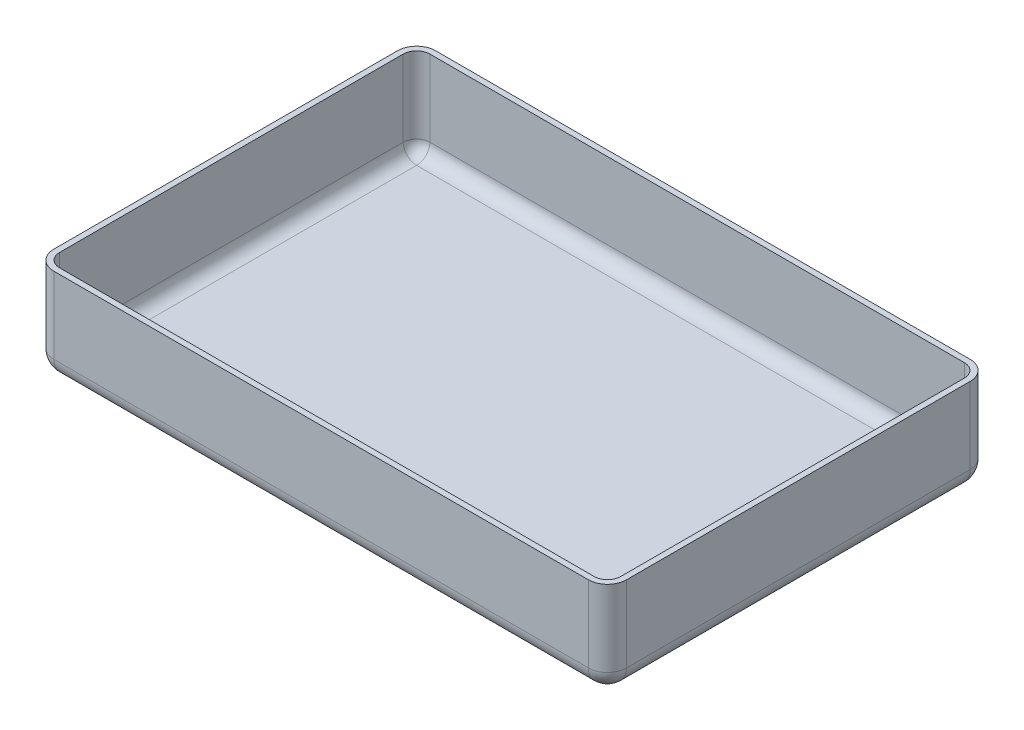
ISO-10303-21;
HEADER;
FILE_DESCRIPTION(('STEP AP214'),'2;1');
FILE_NAME('part.step','',(''),(''),'','','');
FILE_SCHEMA(('AUTOMOTIVE_DESIGN { 1 0 10303 214 1 1 1 1 }'));
ENDSEC;
DATA;
#1=APPLICATION_CONTEXT('core data for automotive mechanical design processes');
#2=APPLICATION_PROTOCOL_DEFINITION('international standard','automotive_design',2000,#1);
#3=PRODUCT_CONTEXT('',#1,'mechanical');
#4=PRODUCT('Part','Part','',(#3));
#5=PRODUCT_RELATED_PRODUCT_CATEGORY('part','',(#4));
#6=PRODUCT_DEFINITION_FORMATION('','',#4);
#7=PRODUCT_DEFINITION_CONTEXT('part definition',#1,'design');
#8=PRODUCT_DEFINITION('design','',#6,#7);
#9=PRODUCT_DEFINITION_SHAPE('','',#8);
#10=(LENGTH_UNIT() NAMED_UNIT(*) SI_UNIT(.MILLI.,.METRE.));
#11=(NAMED_UNIT(*) PLANE_ANGLE_UNIT() SI_UNIT($,.RADIAN.));
#12=(NAMED_UNIT(*) SI_UNIT($,.STERADIAN.) SOLID_ANGLE_UNIT());
#13=UNCERTAINTY_MEASURE_WITH_UNIT(LENGTH_MEASURE(1.E-05),#10,'distance_accuracy_value','');
#14=(GEOMETRIC_REPRESENTATION_CONTEXT(3) GLOBAL_UNCERTAINTY_ASSIGNED_CONTEXT((#13)) GLOBAL_UNIT_ASSIGNED_CONTEXT((#10,
#11,#12)) REPRESENTATION_CONTEXT('',''));
#15=CARTESIAN_POINT('',(0.,0.,0.));
#16=DIRECTION('',(0.,0.,1.));
#17=DIRECTION('',(1.,0.,0.));
#18=AXIS2_PLACEMENT_3D('',#15,#16,#17);
#19=CARTESIAN_POINT('',(-150.,50.,100.));
#20=DIRECTION('',(1.,0.,0.));
#21=DIRECTION('',(0.,0.,-1.));
#22=AXIS2_PLACEMENT_3D('',#19,#20,#21);
#23=PLANE('',#22);
#24=DIRECTION('',(0.,0.,1.));
#25=VECTOR('',#24,1.);
#26=CARTESIAN_POINT('',(-150.,50.,100.));
#27=LINE('',#26,#25);
#28=CARTESIAN_POINT('',(-150.,50.,-90.));
#29=VERTEX_POINT('',#28);
#30=CARTESIAN_POINT('',(-150.,50.,90.));
#31=VERTEX_POINT('',#30);
#32=EDGE_CURVE('E321',#29,#31,#27,.T.);
#33=ORIENTED_EDGE('',*,*,#32,.F.);
#34=DIRECTION('',(0.,-1.,0.));
#35=VECTOR('',#34,1.);
#36=CARTESIAN_POINT('',(-150.,50.,-90.));
#37=LINE('',#36,#35);
#38=CARTESIAN_POINT('',(-150.,10.,-90.));
#39=VERTEX_POINT('',#38);
#40=EDGE_CURVE('E65',#29,#39,#37,.T.);
#41=ORIENTED_EDGE('',*,*,#40,.T.);
#42=DIRECTION('',(0.,0.,1.));
#43=VECTOR('',#42,1.);
#44=CARTESIAN_POINT('',(-150.,10.,100.));
#45=LINE('',#44,#43);
#46=CARTESIAN_POINT('',(-150.,10.,90.));
#47=VERTEX_POINT('',#46);
#48=EDGE_CURVE('E381',#39,#47,#45,.T.);
#49=ORIENTED_EDGE('',*,*,#48,.T.);
#50=DIRECTION('',(0.,-1.,0.));
#51=VECTOR('',#50,1.);
#52=CARTESIAN_POINT('',(-150.,50.,90.));
#53=LINE('',#52,#51);
#54=EDGE_CURVE('E378',#47,#31,#53,.F.);
#55=ORIENTED_EDGE('',*,*,#54,.T.);
#56=EDGE_LOOP('',(#33,#41,#49,#55));
#57=FACE_BOUND('',#56,.T.);
#58=ADVANCED_FACE('F39',(#57),#23,.F.);
#59=CARTESIAN_POINT('',(150.,50.,100.));
#60=DIRECTION('',(0.,0.,-1.));
#61=DIRECTION('',(-1.,0.,0.));
#62=AXIS2_PLACEMENT_3D('',#59,#60,#61);
#63=PLANE('',#62);
#64=DIRECTION('',(1.,0.,0.));
#65=VECTOR('',#64,1.);
#66=CARTESIAN_POINT('',(150.,10.,100.));
#67=LINE('',#66,#65);
#68=CARTESIAN_POINT('',(-140.,10.,100.));
#69=VERTEX_POINT('',#68);
#70=CARTESIAN_POINT('',(140.,10.,100.));
#71=VERTEX_POINT('',#70);
#72=EDGE_CURVE('E340',#69,#71,#67,.T.);
#73=ORIENTED_EDGE('',*,*,#72,.T.);
#74=DIRECTION('',(0.,-1.,0.));
#75=VECTOR('',#74,1.);
#76=CARTESIAN_POINT('',(140.,50.,100.));
#77=LINE('',#76,#75);
#78=CARTESIAN_POINT('',(140.,50.,100.));
#79=VERTEX_POINT('',#78);
#80=EDGE_CURVE('E344',#71,#79,#77,.F.);
#81=ORIENTED_EDGE('',*,*,#80,.T.);
#82=DIRECTION('',(1.,0.,0.));
#83=VECTOR('',#82,1.);
#84=CARTESIAN_POINT('',(150.,50.,100.));
#85=LINE('',#84,#83);
#86=CARTESIAN_POINT('',(-140.,50.,100.));
#87=VERTEX_POINT('',#86);
#88=EDGE_CURVE('E325',#87,#79,#85,.T.);
#89=ORIENTED_EDGE('',*,*,#88,.F.);
#90=DIRECTION('',(0.,-1.,0.));
#91=VECTOR('',#90,1.);
#92=CARTESIAN_POINT('',(-140.,50.,100.));
#93=LINE('',#92,#91);
#94=EDGE_CURVE('E337',#87,#69,#93,.T.);
#95=ORIENTED_EDGE('',*,*,#94,.T.);
#96=EDGE_LOOP('',(#73,#81,#89,#95));
#97=FACE_BOUND('',#96,.T.);
#98=ADVANCED_FACE('F459',(#97),#63,.F.);
#99=CARTESIAN_POINT('',(150.,50.,100.));
#100=DIRECTION('',(-1.,0.,0.));
#101=DIRECTION('',(0.,0.,1.));
#102=AXIS2_PLACEMENT_3D('',#99,#100,#101);
#103=PLANE('',#102);
#104=DIRECTION('',(0.,0.,-1.));
#105=VECTOR('',#104,1.);
#106=CARTESIAN_POINT('',(150.,10.,100.));
#107=LINE('',#106,#105);
#108=CARTESIAN_POINT('',(150.,10.,90.));
#109=VERTEX_POINT('',#108);
#110=CARTESIAN_POINT('',(150.,10.,-90.));
#111=VERTEX_POINT('',#110);
#112=EDGE_CURVE('E363',#109,#111,#107,.T.);
#113=ORIENTED_EDGE('',*,*,#112,.T.);
#114=DIRECTION('',(0.,-1.,0.));
#115=VECTOR('',#114,1.);
#116=CARTESIAN_POINT('',(150.,50.,-90.));
#117=LINE('',#116,#115);
#118=CARTESIAN_POINT('',(150.,50.,-90.));
#119=VERTEX_POINT('',#118);
#120=EDGE_CURVE('E366',#111,#119,#117,.F.);
#121=ORIENTED_EDGE('',*,*,#120,.T.);
#122=DIRECTION('',(0.,0.,-1.));
#123=VECTOR('',#122,1.);
#124=CARTESIAN_POINT('',(150.,50.,100.));
#125=LINE('',#124,#123);
#126=CARTESIAN_POINT('',(150.,50.,90.));
#127=VERTEX_POINT('',#126);
#128=EDGE_CURVE('E329',#127,#119,#125,.T.);
#129=ORIENTED_EDGE('',*,*,#128,.F.);
#130=DIRECTION('',(0.,-1.,0.));
#131=VECTOR('',#130,1.);
#132=CARTESIAN_POINT('',(150.,50.,90.));
#133=LINE('',#132,#131);
#134=EDGE_CURVE('E360',#127,#109,#133,.T.);
#135=ORIENTED_EDGE('',*,*,#134,.T.);
#136=EDGE_LOOP('',(#113,#121,#129,#135));
#137=FACE_BOUND('',#136,.T.);
#138=ADVANCED_FACE('F469',(#137),#103,.F.);
#139=CARTESIAN_POINT('',(150.,50.,-100.));
#140=DIRECTION('',(0.,0.,1.));
#141=DIRECTION('',(1.,0.,0.));
#142=AXIS2_PLACEMENT_3D('',#139,#140,#141);
#143=PLANE('',#142);
#144=DIRECTION('',(-1.,0.,0.));
#145=VECTOR('',#144,1.);
#146=CARTESIAN_POINT('',(150.,10.,-100.));
#147=LINE('',#146,#145);
#148=CARTESIAN_POINT('',(140.,10.,-100.));
#149=VERTEX_POINT('',#148);
#150=CARTESIAN_POINT('',(-140.,10.,-100.));
#151=VERTEX_POINT('',#150);
#152=EDGE_CURVE('E372',#149,#151,#147,.T.);
#153=ORIENTED_EDGE('',*,*,#152,.T.);
#154=DIRECTION('',(0.,-1.,0.));
#155=VECTOR('',#154,1.);
#156=CARTESIAN_POINT('',(-140.,50.,-100.));
#157=LINE('',#156,#155);
#158=CARTESIAN_POINT('',(-140.,50.,-100.));
#159=VERTEX_POINT('',#158);
#160=EDGE_CURVE('E375',#151,#159,#157,.F.);
#161=ORIENTED_EDGE('',*,*,#160,.T.);
#162=DIRECTION('',(-1.,0.,0.));
#163=VECTOR('',#162,1.);
#164=CARTESIAN_POINT('',(150.,50.,-100.));
#165=LINE('',#164,#163);
#166=CARTESIAN_POINT('',(140.,50.,-100.));
#167=VERTEX_POINT('',#166);
#168=EDGE_CURVE('E333',#167,#159,#165,.T.);
#169=ORIENTED_EDGE('',*,*,#168,.F.);
#170=DIRECTION('',(0.,-1.,0.));
#171=VECTOR('',#170,1.);
#172=CARTESIAN_POINT('',(140.,50.,-100.));
#173=LINE('',#172,#171);
#174=EDGE_CURVE('E369',#167,#149,#173,.T.);
#175=ORIENTED_EDGE('',*,*,#174,.T.);
#176=EDGE_LOOP('',(#153,#161,#169,#175));
#177=FACE_BOUND('',#176,.T.);
#178=ADVANCED_FACE('F490',(#177),#143,.F.);
#179=CARTESIAN_POINT('',(0.,50.,0.));
#180=DIRECTION('',(0.,1.,0.));
#181=DIRECTION('',(0.,0.,1.));
#182=AXIS2_PLACEMENT_3D('',#179,#180,#181);
#183=PLANE('',#182);
#184=DIRECTION('',(-1.,0.,0.));
#185=VECTOR('',#184,1.);
#186=CARTESIAN_POINT('',(150.,50.,-97.));
#187=LINE('',#186,#185);
#188=CARTESIAN_POINT('',(140.,50.,-97.));
#189=VERTEX_POINT('',#188);
#190=CARTESIAN_POINT('',(-140.,50.,-97.));
#191=VERTEX_POINT('',#190);
#192=EDGE_CURVE('E280',#189,#191,#187,.T.);
#193=ORIENTED_EDGE('',*,*,#192,.F.);
#194=CARTESIAN_POINT('',(140.,50.,-90.));
#195=DIRECTION('',(0.,1.,0.));
#196=DIRECTION('',(0.,0.,1.));
#197=AXIS2_PLACEMENT_3D('',#194,#195,#196);
#198=CIRCLE('',#197,7.);
#199=CARTESIAN_POINT('',(147.,50.,-90.));
#200=VERTEX_POINT('',#199);
#201=EDGE_CURVE('E310',#200,#189,#198,.T.);
#202=ORIENTED_EDGE('',*,*,#201,.F.);
#203=DIRECTION('',(0.,0.,-1.));
#204=VECTOR('',#203,1.);
#205=CARTESIAN_POINT('',(147.,50.,100.));
#206=LINE('',#205,#204);
#207=CARTESIAN_POINT('',(147.,50.,90.));
#208=VERTEX_POINT('',#207);
#209=EDGE_CURVE('E57',#208,#200,#206,.T.);
#210=ORIENTED_EDGE('',*,*,#209,.F.);
#211=CARTESIAN_POINT('',(140.,50.,90.));
#212=DIRECTION('',(0.,1.,0.));
#213=DIRECTION('',(0.,0.,1.));
#214=AXIS2_PLACEMENT_3D('',#211,#212,#213);
#215=CIRCLE('',#214,7.);
#216=CARTESIAN_POINT('',(140.,50.,97.));
#217=VERTEX_POINT('',#216);
#218=EDGE_CURVE('E304',#217,#208,#215,.T.);
#219=ORIENTED_EDGE('',*,*,#218,.F.);
#220=DIRECTION('',(1.,0.,0.));
#221=VECTOR('',#220,1.);
#222=CARTESIAN_POINT('',(150.,50.,97.));
#223=LINE('',#222,#221);
#224=CARTESIAN_POINT('',(-140.,50.,97.));
#225=VERTEX_POINT('',#224);
#226=EDGE_CURVE('E301',#225,#217,#223,.T.);
#227=ORIENTED_EDGE('',*,*,#226,.F.);
#228=CARTESIAN_POINT('',(-140.,50.,90.));
#229=DIRECTION('',(0.,1.,0.));
#230=DIRECTION('',(0.,0.,1.));
#231=AXIS2_PLACEMENT_3D('',#228,#229,#230);
#232=CIRCLE('',#231,7.);
#233=CARTESIAN_POINT('',(-147.,50.,90.));
#234=VERTEX_POINT('',#233);
#235=EDGE_CURVE('E192',#234,#225,#232,.T.);
#236=ORIENTED_EDGE('',*,*,#235,.F.);
#237=DIRECTION('',(0.,0.,1.));
#238=VECTOR('',#237,1.);
#239=CARTESIAN_POINT('',(-147.,50.,100.));
#240=LINE('',#239,#238);
#241=CARTESIAN_POINT('',(-147.,50.,-90.));
#242=VERTEX_POINT('',#241);
#243=EDGE_CURVE('E267',#242,#234,#240,.T.);
#244=ORIENTED_EDGE('',*,*,#243,.F.);
#245=CARTESIAN_POINT('',(-140.,50.,-90.));
#246=DIRECTION('',(0.,1.,0.));
#247=DIRECTION('',(0.,0.,1.));
#248=AXIS2_PLACEMENT_3D('',#245,#246,#247);
#249=CIRCLE('',#248,7.);
#250=EDGE_CURVE('E186',#191,#242,#249,.T.);
#251=ORIENTED_EDGE('',*,*,#250,.F.);
#252=EDGE_LOOP('',(#193,#202,#210,#219,#227,#236,#244,#251));
#253=FACE_BOUND('',#252,.T.);
#254=ORIENTED_EDGE('',*,*,#168,.T.);
#255=CARTESIAN_POINT('',(-140.,50.,-90.));
#256=DIRECTION('',(0.,1.,0.));
#257=DIRECTION('',(0.,0.,1.));
#258=AXIS2_PLACEMENT_3D('',#255,#256,#257);
#259=CIRCLE('',#258,10.);
#260=EDGE_CURVE('E11',#159,#29,#259,.T.);
#261=ORIENTED_EDGE('',*,*,#260,.T.);
#262=ORIENTED_EDGE('',*,*,#32,.T.);
#263=CARTESIAN_POINT('',(-140.,50.,90.));
#264=DIRECTION('',(0.,1.,0.));
#265=DIRECTION('',(0.,0.,1.));
#266=AXIS2_PLACEMENT_3D('',#263,#264,#265);
#267=CIRCLE('',#266,10.);
#268=EDGE_CURVE('E386',#31,#87,#267,.T.);
#269=ORIENTED_EDGE('',*,*,#268,.T.);
#270=ORIENTED_EDGE('',*,*,#88,.T.);
#271=CARTESIAN_POINT('',(140.,50.,90.));
#272=DIRECTION('',(0.,1.,0.));
#273=DIRECTION('',(0.,0.,1.));
#274=AXIS2_PLACEMENT_3D('',#271,#272,#273);
#275=CIRCLE('',#274,10.);
#276=EDGE_CURVE('E389',#79,#127,#275,.T.);
#277=ORIENTED_EDGE('',*,*,#276,.T.);
#278=ORIENTED_EDGE('',*,*,#128,.T.);
#279=CARTESIAN_POINT('',(140.,50.,-90.));
#280=DIRECTION('',(0.,1.,0.));
#281=DIRECTION('',(0.,0.,1.));
#282=AXIS2_PLACEMENT_3D('',#279,#280,#281);
#283=CIRCLE('',#282,10.);
#284=EDGE_CURVE('E49',#119,#167,#283,.T.);
#285=ORIENTED_EDGE('',*,*,#284,.T.);
#286=EDGE_LOOP('',(#254,#261,#262,#269,#270,#277,#278,#285));
#287=FACE_BOUND('',#286,.T.);
#288=ADVANCED_FACE('F456',(#253,#287),#183,.T.);
#289=CARTESIAN_POINT('',(0.,0.,0.));
#290=DIRECTION('',(0.,1.,0.));
#291=DIRECTION('',(0.,0.,1.));
#292=AXIS2_PLACEMENT_3D('',#289,#290,#291);
#293=PLANE('',#292);
#294=DIRECTION('',(0.,0.,-1.));
#295=VECTOR('',#294,1.);
#296=CARTESIAN_POINT('',(140.,0.,0.));
#297=LINE('',#296,#295);
#298=CARTESIAN_POINT('',(140.,0.,-90.));
#299=VERTEX_POINT('',#298);
#300=CARTESIAN_POINT('',(140.,0.,90.));
#301=VERTEX_POINT('',#300);
#302=EDGE_CURVE('E353',#299,#301,#297,.F.);
#303=ORIENTED_EDGE('',*,*,#302,.T.);
#304=DIRECTION('',(1.,0.,0.));
#305=VECTOR('',#304,1.);
#306=CARTESIAN_POINT('',(0.,0.,90.));
#307=LINE('',#306,#305);
#308=CARTESIAN_POINT('',(-140.,0.,90.));
#309=VERTEX_POINT('',#308);
#310=EDGE_CURVE('E356',#301,#309,#307,.F.);
#311=ORIENTED_EDGE('',*,*,#310,.T.);
#312=DIRECTION('',(0.,0.,1.));
#313=VECTOR('',#312,1.);
#314=CARTESIAN_POINT('',(-140.,0.,0.));
#315=LINE('',#314,#313);
#316=CARTESIAN_POINT('',(-140.,0.,-90.));
#317=VERTEX_POINT('',#316);
#318=EDGE_CURVE('E347',#309,#317,#315,.F.);
#319=ORIENTED_EDGE('',*,*,#318,.T.);
#320=DIRECTION('',(-1.,0.,0.));
#321=VECTOR('',#320,1.);
#322=CARTESIAN_POINT('',(0.,0.,-90.));
#323=LINE('',#322,#321);
#324=EDGE_CURVE('E350',#317,#299,#323,.F.);
#325=ORIENTED_EDGE('',*,*,#324,.T.);
#326=EDGE_LOOP('',(#303,#311,#319,#325));
#327=FACE_BOUND('',#326,.T.);
#328=ADVANCED_FACE('F486',(#327),#293,.F.);
#329=CARTESIAN_POINT('',(-140.,50.,-90.));
#330=DIRECTION('',(0.,-1.,0.));
#331=DIRECTION('',(0.,0.,-1.));
#332=AXIS2_PLACEMENT_3D('',#329,#330,#331);
#333=CYLINDRICAL_SURFACE('',#332,10.);
#334=ORIENTED_EDGE('',*,*,#260,.F.);
#335=ORIENTED_EDGE('',*,*,#160,.F.);
#336=CARTESIAN_POINT('',(-140.,10.,-90.));
#337=DIRECTION('',(0.,-1.,0.));
#338=DIRECTION('',(0.,0.,-1.));
#339=AXIS2_PLACEMENT_3D('',#336,#337,#338);
#340=CIRCLE('',#339,10.);
#341=EDGE_CURVE('E430',#39,#151,#340,.T.);
#342=ORIENTED_EDGE('',*,*,#341,.F.);
#343=ORIENTED_EDGE('',*,*,#40,.F.);
#344=EDGE_LOOP('',(#334,#335,#342,#343));
#345=FACE_BOUND('',#344,.T.);
#346=ADVANCED_FACE('F41',(#345),#333,.T.);
#347=CARTESIAN_POINT('',(140.,50.,-90.));
#348=DIRECTION('',(0.,-1.,0.));
#349=DIRECTION('',(0.,0.,-1.));
#350=AXIS2_PLACEMENT_3D('',#347,#348,#349);
#351=CYLINDRICAL_SURFACE('',#350,10.);
#352=ORIENTED_EDGE('',*,*,#284,.F.);
#353=ORIENTED_EDGE('',*,*,#120,.F.);
#354=CARTESIAN_POINT('',(140.,10.,-90.));
#355=DIRECTION('',(0.,-1.,0.));
#356=DIRECTION('',(0.,0.,-1.));
#357=AXIS2_PLACEMENT_3D('',#354,#355,#356);
#358=CIRCLE('',#357,10.);
#359=EDGE_CURVE('E427',#149,#111,#358,.T.);
#360=ORIENTED_EDGE('',*,*,#359,.F.);
#361=ORIENTED_EDGE('',*,*,#174,.F.);
#362=EDGE_LOOP('',(#352,#353,#360,#361));
#363=FACE_BOUND('',#362,.T.);
#364=ADVANCED_FACE('F474',(#363),#351,.T.);
#365=CARTESIAN_POINT('',(150.,10.,-90.));
#366=DIRECTION('',(-1.,0.,0.));
#367=DIRECTION('',(0.,0.,1.));
#368=AXIS2_PLACEMENT_3D('',#365,#366,#367);
#369=CYLINDRICAL_SURFACE('',#368,10.);
#370=CARTESIAN_POINT('',(-140.,10.,-90.));
#371=DIRECTION('',(-1.,0.,0.));
#372=DIRECTION('',(0.,0.,1.));
#373=AXIS2_PLACEMENT_3D('',#370,#371,#372);
#374=CIRCLE('',#373,10.);
#375=EDGE_CURVE('E43',#151,#317,#374,.T.);
#376=ORIENTED_EDGE('',*,*,#375,.F.);
#377=ORIENTED_EDGE('',*,*,#152,.F.);
#378=CARTESIAN_POINT('',(140.,10.,-90.));
#379=DIRECTION('',(1.,0.,0.));
#380=DIRECTION('',(0.,0.,-1.));
#381=AXIS2_PLACEMENT_3D('',#378,#379,#380);
#382=CIRCLE('',#381,10.);
#383=EDGE_CURVE('E423',#299,#149,#382,.T.);
#384=ORIENTED_EDGE('',*,*,#383,.F.);
#385=ORIENTED_EDGE('',*,*,#324,.F.);
#386=EDGE_LOOP('',(#376,#377,#384,#385));
#387=FACE_BOUND('',#386,.T.);
#388=ADVANCED_FACE('F487',(#387),#369,.T.);
#389=CARTESIAN_POINT('',(-140.,10.,-90.));
#390=DIRECTION('',(0.,0.,1.));
#391=DIRECTION('',(1.,0.,0.));
#392=AXIS2_PLACEMENT_3D('',#389,#390,#391);
#393=SPHERICAL_SURFACE('',#392,10.);
#394=ORIENTED_EDGE('',*,*,#341,.T.);
#395=ORIENTED_EDGE('',*,*,#375,.T.);
#396=CARTESIAN_POINT('',(-140.,10.,-90.));
#397=DIRECTION('',(0.,0.,-1.));
#398=DIRECTION('',(-1.,0.,0.));
#399=AXIS2_PLACEMENT_3D('',#396,#397,#398);
#400=CIRCLE('',#399,10.);
#401=EDGE_CURVE('E419',#39,#317,#400,.F.);
#402=ORIENTED_EDGE('',*,*,#401,.F.);
#403=EDGE_LOOP('',(#394,#395,#402));
#404=FACE_BOUND('',#403,.T.);
#405=ADVANCED_FACE('F438',(#404),#393,.T.);
#406=CARTESIAN_POINT('',(140.,10.,-90.));
#407=DIRECTION('',(0.,0.,1.));
#408=DIRECTION('',(1.,0.,0.));
#409=AXIS2_PLACEMENT_3D('',#406,#407,#408);
#410=SPHERICAL_SURFACE('',#409,10.);
#411=ORIENTED_EDGE('',*,*,#383,.T.);
#412=ORIENTED_EDGE('',*,*,#359,.T.);
#413=CARTESIAN_POINT('',(140.,10.,-90.));
#414=DIRECTION('',(0.,0.,-1.));
#415=DIRECTION('',(-1.,0.,0.));
#416=AXIS2_PLACEMENT_3D('',#413,#414,#415);
#417=CIRCLE('',#416,10.);
#418=EDGE_CURVE('E415',#299,#111,#417,.F.);
#419=ORIENTED_EDGE('',*,*,#418,.F.);
#420=EDGE_LOOP('',(#411,#412,#419));
#421=FACE_BOUND('',#420,.T.);
#422=ADVANCED_FACE('F478',(#421),#410,.T.);
#423=CARTESIAN_POINT('',(-140.,10.,100.));
#424=DIRECTION('',(0.,0.,1.));
#425=DIRECTION('',(1.,0.,0.));
#426=AXIS2_PLACEMENT_3D('',#423,#424,#425);
#427=CYLINDRICAL_SURFACE('',#426,10.);
#428=ORIENTED_EDGE('',*,*,#401,.T.);
#429=ORIENTED_EDGE('',*,*,#318,.F.);
#430=CARTESIAN_POINT('',(-140.,10.,90.));
#431=DIRECTION('',(0.,0.,1.));
#432=DIRECTION('',(1.,0.,0.));
#433=AXIS2_PLACEMENT_3D('',#430,#431,#432);
#434=CIRCLE('',#433,10.);
#435=EDGE_CURVE('E411',#47,#309,#434,.T.);
#436=ORIENTED_EDGE('',*,*,#435,.F.);
#437=ORIENTED_EDGE('',*,*,#48,.F.);
#438=EDGE_LOOP('',(#428,#429,#436,#437));
#439=FACE_BOUND('',#438,.T.);
#440=ADVANCED_FACE('F445',(#439),#427,.T.);
#441=CARTESIAN_POINT('',(-140.,50.,90.));
#442=DIRECTION('',(0.,-1.,0.));
#443=DIRECTION('',(0.,0.,-1.));
#444=AXIS2_PLACEMENT_3D('',#441,#442,#443);
#445=CYLINDRICAL_SURFACE('',#444,10.);
#446=ORIENTED_EDGE('',*,*,#268,.F.);
#447=ORIENTED_EDGE('',*,*,#54,.F.);
#448=CARTESIAN_POINT('',(-140.,10.,90.));
#449=DIRECTION('',(0.,-1.,0.));
#450=DIRECTION('',(0.,0.,-1.));
#451=AXIS2_PLACEMENT_3D('',#448,#449,#450);
#452=CIRCLE('',#451,10.);
#453=EDGE_CURVE('E407',#69,#47,#452,.T.);
#454=ORIENTED_EDGE('',*,*,#453,.F.);
#455=ORIENTED_EDGE('',*,*,#94,.F.);
#456=EDGE_LOOP('',(#446,#447,#454,#455));
#457=FACE_BOUND('',#456,.T.);
#458=ADVANCED_FACE('F451',(#457),#445,.T.);
#459=CARTESIAN_POINT('',(140.,50.,90.));
#460=DIRECTION('',(0.,-1.,0.));
#461=DIRECTION('',(0.,0.,-1.));
#462=AXIS2_PLACEMENT_3D('',#459,#460,#461);
#463=CYLINDRICAL_SURFACE('',#462,10.);
#464=ORIENTED_EDGE('',*,*,#276,.F.);
#465=ORIENTED_EDGE('',*,*,#80,.F.);
#466=CARTESIAN_POINT('',(140.,10.,90.));
#467=DIRECTION('',(0.,-1.,0.));
#468=DIRECTION('',(0.,0.,-1.));
#469=AXIS2_PLACEMENT_3D('',#466,#467,#468);
#470=CIRCLE('',#469,10.);
#471=EDGE_CURVE('E403',#109,#71,#470,.T.);
#472=ORIENTED_EDGE('',*,*,#471,.F.);
#473=ORIENTED_EDGE('',*,*,#134,.F.);
#474=EDGE_LOOP('',(#464,#465,#472,#473));
#475=FACE_BOUND('',#474,.T.);
#476=ADVANCED_FACE('F464',(#475),#463,.T.);
#477=CARTESIAN_POINT('',(140.,10.,100.));
#478=DIRECTION('',(0.,0.,-1.));
#479=DIRECTION('',(-1.,0.,0.));
#480=AXIS2_PLACEMENT_3D('',#477,#478,#479);
#481=CYLINDRICAL_SURFACE('',#480,10.);
#482=ORIENTED_EDGE('',*,*,#418,.T.);
#483=ORIENTED_EDGE('',*,*,#112,.F.);
#484=CARTESIAN_POINT('',(140.,10.,90.));
#485=DIRECTION('',(0.,0.,1.));
#486=DIRECTION('',(1.,0.,0.));
#487=AXIS2_PLACEMENT_3D('',#484,#485,#486);
#488=CIRCLE('',#487,10.);
#489=EDGE_CURVE('E399',#301,#109,#488,.T.);
#490=ORIENTED_EDGE('',*,*,#489,.F.);
#491=ORIENTED_EDGE('',*,*,#302,.F.);
#492=EDGE_LOOP('',(#482,#483,#490,#491));
#493=FACE_BOUND('',#492,.T.);
#494=ADVANCED_FACE('F482',(#493),#481,.T.);
#495=CARTESIAN_POINT('',(-140.,10.,90.));
#496=DIRECTION('',(0.,0.,1.));
#497=DIRECTION('',(1.,0.,0.));
#498=AXIS2_PLACEMENT_3D('',#495,#496,#497);
#499=SPHERICAL_SURFACE('',#498,10.);
#500=ORIENTED_EDGE('',*,*,#453,.T.);
#501=ORIENTED_EDGE('',*,*,#435,.T.);
#502=CARTESIAN_POINT('',(-140.,10.,90.));
#503=DIRECTION('',(-1.,0.,0.));
#504=DIRECTION('',(0.,0.,1.));
#505=AXIS2_PLACEMENT_3D('',#502,#503,#504);
#506=CIRCLE('',#505,10.);
#507=EDGE_CURVE('E396',#69,#309,#506,.F.);
#508=ORIENTED_EDGE('',*,*,#507,.F.);
#509=EDGE_LOOP('',(#500,#501,#508));
#510=FACE_BOUND('',#509,.T.);
#511=ADVANCED_FACE('F515',(#510),#499,.T.);
#512=CARTESIAN_POINT('',(140.,10.,90.));
#513=DIRECTION('',(0.,0.,1.));
#514=DIRECTION('',(1.,0.,0.));
#515=AXIS2_PLACEMENT_3D('',#512,#513,#514);
#516=SPHERICAL_SURFACE('',#515,10.);
#517=ORIENTED_EDGE('',*,*,#489,.T.);
#518=ORIENTED_EDGE('',*,*,#471,.T.);
#519=CARTESIAN_POINT('',(140.,10.,90.));
#520=DIRECTION('',(1.,0.,0.));
#521=DIRECTION('',(0.,0.,-1.));
#522=AXIS2_PLACEMENT_3D('',#519,#520,#521);
#523=CIRCLE('',#522,10.);
#524=EDGE_CURVE('E320',#301,#71,#523,.F.);
#525=ORIENTED_EDGE('',*,*,#524,.F.);
#526=EDGE_LOOP('',(#517,#518,#525));
#527=FACE_BOUND('',#526,.T.);
#528=ADVANCED_FACE('F511',(#527),#516,.T.);
#529=CARTESIAN_POINT('',(150.,10.,90.));
#530=DIRECTION('',(1.,0.,0.));
#531=DIRECTION('',(0.,0.,-1.));
#532=AXIS2_PLACEMENT_3D('',#529,#530,#531);
#533=CYLINDRICAL_SURFACE('',#532,10.);
#534=ORIENTED_EDGE('',*,*,#507,.T.);
#535=ORIENTED_EDGE('',*,*,#310,.F.);
#536=ORIENTED_EDGE('',*,*,#524,.T.);
#537=ORIENTED_EDGE('',*,*,#72,.F.);
#538=EDGE_LOOP('',(#534,#535,#536,#537));
#539=FACE_BOUND('',#538,.T.);
#540=ADVANCED_FACE('F508',(#539),#533,.T.);
#541=CARTESIAN_POINT('',(-147.,50.,100.));
#542=DIRECTION('',(1.,0.,0.));
#543=DIRECTION('',(0.,0.,-1.));
#544=AXIS2_PLACEMENT_3D('',#541,#542,#543);
#545=PLANE('',#544);
#546=ORIENTED_EDGE('',*,*,#243,.T.);
#547=DIRECTION('',(0.,1.,0.));
#548=VECTOR('',#547,1.);
#549=CARTESIAN_POINT('',(-147.,50.,90.));
#550=LINE('',#549,#548);
#551=CARTESIAN_POINT('',(-147.,10.,90.));
#552=VERTEX_POINT('',#551);
#553=EDGE_CURVE('E218',#552,#234,#550,.T.);
#554=ORIENTED_EDGE('',*,*,#553,.F.);
#555=DIRECTION('',(0.,0.,-1.));
#556=VECTOR('',#555,1.);
#557=CARTESIAN_POINT('',(-147.,10.,100.));
#558=LINE('',#557,#556);
#559=CARTESIAN_POINT('',(-147.,10.,-90.));
#560=VERTEX_POINT('',#559);
#561=EDGE_CURVE('E193',#560,#552,#558,.F.);
#562=ORIENTED_EDGE('',*,*,#561,.F.);
#563=DIRECTION('',(0.,1.,0.));
#564=VECTOR('',#563,1.);
#565=CARTESIAN_POINT('',(-147.,50.,-90.));
#566=LINE('',#565,#564);
#567=EDGE_CURVE('E181',#242,#560,#566,.F.);
#568=ORIENTED_EDGE('',*,*,#567,.F.);
#569=EDGE_LOOP('',(#546,#554,#562,#568));
#570=FACE_BOUND('',#569,.T.);
#571=ADVANCED_FACE('F217',(#570),#545,.T.);
#572=CARTESIAN_POINT('',(150.,50.,97.));
#573=DIRECTION('',(0.,0.,-1.));
#574=DIRECTION('',(-1.,0.,0.));
#575=AXIS2_PLACEMENT_3D('',#572,#573,#574);
#576=PLANE('',#575);
#577=DIRECTION('',(-1.,0.,0.));
#578=VECTOR('',#577,1.);
#579=CARTESIAN_POINT('',(150.,10.,97.));
#580=LINE('',#579,#578);
#581=CARTESIAN_POINT('',(-140.,10.,97.));
#582=VERTEX_POINT('',#581);
#583=CARTESIAN_POINT('',(140.,10.,97.));
#584=VERTEX_POINT('',#583);
#585=EDGE_CURVE('E279',#582,#584,#580,.F.);
#586=ORIENTED_EDGE('',*,*,#585,.F.);
#587=DIRECTION('',(0.,1.,0.));
#588=VECTOR('',#587,1.);
#589=CARTESIAN_POINT('',(-140.,50.,97.));
#590=LINE('',#589,#588);
#591=EDGE_CURVE('E276',#225,#582,#590,.F.);
#592=ORIENTED_EDGE('',*,*,#591,.F.);
#593=ORIENTED_EDGE('',*,*,#226,.T.);
#594=DIRECTION('',(0.,1.,0.));
#595=VECTOR('',#594,1.);
#596=CARTESIAN_POINT('',(140.,50.,97.));
#597=LINE('',#596,#595);
#598=EDGE_CURVE('E263',#584,#217,#597,.T.);
#599=ORIENTED_EDGE('',*,*,#598,.F.);
#600=EDGE_LOOP('',(#586,#592,#593,#599));
#601=FACE_BOUND('',#600,.T.);
#602=ADVANCED_FACE('F580',(#601),#576,.T.);
#603=CARTESIAN_POINT('',(147.,50.,100.));
#604=DIRECTION('',(-1.,0.,0.));
#605=DIRECTION('',(0.,0.,1.));
#606=AXIS2_PLACEMENT_3D('',#603,#604,#605);
#607=PLANE('',#606);
#608=DIRECTION('',(0.,0.,1.));
#609=VECTOR('',#608,1.);
#610=CARTESIAN_POINT('',(147.,10.,100.));
#611=LINE('',#610,#609);
#612=CARTESIAN_POINT('',(147.,10.,90.));
#613=VERTEX_POINT('',#612);
#614=CARTESIAN_POINT('',(147.,10.,-90.));
#615=VERTEX_POINT('',#614);
#616=EDGE_CURVE('E237',#613,#615,#611,.F.);
#617=ORIENTED_EDGE('',*,*,#616,.F.);
#618=DIRECTION('',(0.,1.,0.));
#619=VECTOR('',#618,1.);
#620=CARTESIAN_POINT('',(147.,50.,90.));
#621=LINE('',#620,#619);
#622=EDGE_CURVE('E243',#208,#613,#621,.F.);
#623=ORIENTED_EDGE('',*,*,#622,.F.);
#624=ORIENTED_EDGE('',*,*,#209,.T.);
#625=DIRECTION('',(0.,1.,0.));
#626=VECTOR('',#625,1.);
#627=CARTESIAN_POINT('',(147.,50.,-90.));
#628=LINE('',#627,#626);
#629=EDGE_CURVE('E234',#615,#200,#628,.T.);
#630=ORIENTED_EDGE('',*,*,#629,.F.);
#631=EDGE_LOOP('',(#617,#623,#624,#630));
#632=FACE_BOUND('',#631,.T.);
#633=ADVANCED_FACE('F587',(#632),#607,.T.);
#634=CARTESIAN_POINT('',(150.,50.,-97.));
#635=DIRECTION('',(0.,0.,1.));
#636=DIRECTION('',(1.,0.,0.));
#637=AXIS2_PLACEMENT_3D('',#634,#635,#636);
#638=PLANE('',#637);
#639=DIRECTION('',(1.,0.,0.));
#640=VECTOR('',#639,1.);
#641=CARTESIAN_POINT('',(150.,10.,-97.));
#642=LINE('',#641,#640);
#643=CARTESIAN_POINT('',(140.,10.,-97.));
#644=VERTEX_POINT('',#643);
#645=CARTESIAN_POINT('',(-140.,10.,-97.));
#646=VERTEX_POINT('',#645);
#647=EDGE_CURVE('E227',#644,#646,#642,.F.);
#648=ORIENTED_EDGE('',*,*,#647,.F.);
#649=DIRECTION('',(0.,1.,0.));
#650=VECTOR('',#649,1.);
#651=CARTESIAN_POINT('',(140.,50.,-97.));
#652=LINE('',#651,#650);
#653=EDGE_CURVE('E231',#189,#644,#652,.F.);
#654=ORIENTED_EDGE('',*,*,#653,.F.);
#655=ORIENTED_EDGE('',*,*,#192,.T.);
#656=DIRECTION('',(0.,1.,0.));
#657=VECTOR('',#656,1.);
#658=CARTESIAN_POINT('',(-140.,50.,-97.));
#659=LINE('',#658,#657);
#660=EDGE_CURVE('E223',#646,#191,#659,.T.);
#661=ORIENTED_EDGE('',*,*,#660,.F.);
#662=EDGE_LOOP('',(#648,#654,#655,#661));
#663=FACE_BOUND('',#662,.T.);
#664=ADVANCED_FACE('F595',(#663),#638,.T.);
#665=CARTESIAN_POINT('',(0.,3.,0.));
#666=DIRECTION('',(0.,1.,0.));
#667=DIRECTION('',(0.,0.,1.));
#668=AXIS2_PLACEMENT_3D('',#665,#666,#667);
#669=PLANE('',#668);
#670=DIRECTION('',(0.,0.,1.));
#671=VECTOR('',#670,1.);
#672=CARTESIAN_POINT('',(140.,3.,0.));
#673=LINE('',#672,#671);
#674=CARTESIAN_POINT('',(140.,3.,-90.));
#675=VERTEX_POINT('',#674);
#676=CARTESIAN_POINT('',(140.,3.,90.));
#677=VERTEX_POINT('',#676);
#678=EDGE_CURVE('E254',#675,#677,#673,.T.);
#679=ORIENTED_EDGE('',*,*,#678,.F.);
#680=DIRECTION('',(1.,0.,0.));
#681=VECTOR('',#680,1.);
#682=CARTESIAN_POINT('',(0.,3.,-90.));
#683=LINE('',#682,#681);
#684=CARTESIAN_POINT('',(-140.,3.,-90.));
#685=VERTEX_POINT('',#684);
#686=EDGE_CURVE('E257',#685,#675,#683,.T.);
#687=ORIENTED_EDGE('',*,*,#686,.F.);
#688=DIRECTION('',(0.,0.,1.));
#689=VECTOR('',#688,1.);
#690=CARTESIAN_POINT('',(-140.,3.,0.));
#691=LINE('',#690,#689);
#692=CARTESIAN_POINT('',(-140.,3.,90.));
#693=VERTEX_POINT('',#692);
#694=EDGE_CURVE('E211',#693,#685,#691,.F.);
#695=ORIENTED_EDGE('',*,*,#694,.F.);
#696=DIRECTION('',(1.,0.,0.));
#697=VECTOR('',#696,1.);
#698=CARTESIAN_POINT('',(0.,3.,90.));
#699=LINE('',#698,#697);
#700=EDGE_CURVE('E246',#677,#693,#699,.F.);
#701=ORIENTED_EDGE('',*,*,#700,.F.);
#702=EDGE_LOOP('',(#679,#687,#695,#701));
#703=FACE_BOUND('',#702,.T.);
#704=ADVANCED_FACE('F602',(#703),#669,.T.);
#705=CARTESIAN_POINT('',(-140.,50.,-90.));
#706=DIRECTION('',(0.,-1.,0.));
#707=DIRECTION('',(0.,0.,-1.));
#708=AXIS2_PLACEMENT_3D('',#705,#706,#707);
#709=CYLINDRICAL_SURFACE('',#708,7.);
#710=ORIENTED_EDGE('',*,*,#250,.T.);
#711=ORIENTED_EDGE('',*,*,#567,.T.);
#712=CARTESIAN_POINT('',(-140.,10.,-90.));
#713=DIRECTION('',(0.,1.,0.));
#714=DIRECTION('',(-1.,0.,0.));
#715=AXIS2_PLACEMENT_3D('',#712,#713,#714);
#716=CIRCLE('',#715,7.);
#717=EDGE_CURVE('E184',#560,#646,#716,.F.);
#718=ORIENTED_EDGE('',*,*,#717,.T.);
#719=ORIENTED_EDGE('',*,*,#660,.T.);
#720=EDGE_LOOP('',(#710,#711,#718,#719));
#721=FACE_BOUND('',#720,.T.);
#722=ADVANCED_FACE('F183',(#721),#709,.F.);
#723=CARTESIAN_POINT('',(140.,50.,-90.));
#724=DIRECTION('',(0.,-1.,0.));
#725=DIRECTION('',(0.,0.,-1.));
#726=AXIS2_PLACEMENT_3D('',#723,#724,#725);
#727=CYLINDRICAL_SURFACE('',#726,7.);
#728=ORIENTED_EDGE('',*,*,#201,.T.);
#729=ORIENTED_EDGE('',*,*,#653,.T.);
#730=CARTESIAN_POINT('',(140.,10.,-90.));
#731=DIRECTION('',(0.,-1.,0.));
#732=DIRECTION('',(1.,0.,0.));
#733=AXIS2_PLACEMENT_3D('',#730,#731,#732);
#734=CIRCLE('',#733,7.);
#735=EDGE_CURVE('E204',#644,#615,#734,.T.);
#736=ORIENTED_EDGE('',*,*,#735,.T.);
#737=ORIENTED_EDGE('',*,*,#629,.T.);
#738=EDGE_LOOP('',(#728,#729,#736,#737));
#739=FACE_BOUND('',#738,.T.);
#740=ADVANCED_FACE('F617',(#739),#727,.F.);
#741=CARTESIAN_POINT('',(150.,10.,-90.));
#742=DIRECTION('',(-1.,0.,0.));
#743=DIRECTION('',(0.,0.,1.));
#744=AXIS2_PLACEMENT_3D('',#741,#742,#743);
#745=CYLINDRICAL_SURFACE('',#744,7.);
#746=CARTESIAN_POINT('',(-140.,10.,-90.));
#747=DIRECTION('',(-1.,0.,0.));
#748=DIRECTION('',(0.,-1.,0.));
#749=AXIS2_PLACEMENT_3D('',#746,#747,#748);
#750=CIRCLE('',#749,7.);
#751=EDGE_CURVE('E202',#646,#685,#750,.T.);
#752=ORIENTED_EDGE('',*,*,#751,.T.);
#753=ORIENTED_EDGE('',*,*,#686,.T.);
#754=CARTESIAN_POINT('',(140.,10.,-90.));
#755=DIRECTION('',(-1.,0.,0.));
#756=DIRECTION('',(0.,-1.,0.));
#757=AXIS2_PLACEMENT_3D('',#754,#755,#756);
#758=CIRCLE('',#757,7.);
#759=EDGE_CURVE('E214',#675,#644,#758,.F.);
#760=ORIENTED_EDGE('',*,*,#759,.T.);
#761=ORIENTED_EDGE('',*,*,#647,.T.);
#762=EDGE_LOOP('',(#752,#753,#760,#761));
#763=FACE_BOUND('',#762,.T.);
#764=ADVANCED_FACE('F624',(#763),#745,.F.);
#765=CARTESIAN_POINT('',(-140.,10.,-90.));
#766=DIRECTION('',(0.,0.,1.));
#767=DIRECTION('',(1.,0.,0.));
#768=AXIS2_PLACEMENT_3D('',#765,#766,#767);
#769=SPHERICAL_SURFACE('',#768,7.);
#770=ORIENTED_EDGE('',*,*,#717,.F.);
#771=CARTESIAN_POINT('',(-140.,10.,-90.));
#772=DIRECTION('',(0.,0.,1.));
#773=DIRECTION('',(1.,0.,0.));
#774=AXIS2_PLACEMENT_3D('',#771,#772,#773);
#775=CIRCLE('',#774,7.);
#776=EDGE_CURVE('E200',#560,#685,#775,.T.);
#777=ORIENTED_EDGE('',*,*,#776,.T.);
#778=ORIENTED_EDGE('',*,*,#751,.F.);
#779=EDGE_LOOP('',(#770,#777,#778));
#780=FACE_BOUND('',#779,.T.);
#781=ADVANCED_FACE('F199',(#780),#769,.F.);
#782=CARTESIAN_POINT('',(140.,10.,-90.));
#783=DIRECTION('',(0.,0.,1.));
#784=DIRECTION('',(1.,0.,0.));
#785=AXIS2_PLACEMENT_3D('',#782,#783,#784);
#786=SPHERICAL_SURFACE('',#785,7.);
#787=ORIENTED_EDGE('',*,*,#759,.F.);
#788=CARTESIAN_POINT('',(140.,10.,-90.));
#789=DIRECTION('',(0.,0.,-1.));
#790=DIRECTION('',(-1.,0.,0.));
#791=AXIS2_PLACEMENT_3D('',#788,#789,#790);
#792=CIRCLE('',#791,7.);
#793=EDGE_CURVE('E215',#675,#615,#792,.F.);
#794=ORIENTED_EDGE('',*,*,#793,.T.);
#795=ORIENTED_EDGE('',*,*,#735,.F.);
#796=EDGE_LOOP('',(#787,#794,#795));
#797=FACE_BOUND('',#796,.T.);
#798=ADVANCED_FACE('F639',(#797),#786,.F.);
#799=CARTESIAN_POINT('',(-140.,10.,100.));
#800=DIRECTION('',(0.,0.,1.));
#801=DIRECTION('',(1.,0.,0.));
#802=AXIS2_PLACEMENT_3D('',#799,#800,#801);
#803=CYLINDRICAL_SURFACE('',#802,7.);
#804=ORIENTED_EDGE('',*,*,#776,.F.);
#805=ORIENTED_EDGE('',*,*,#561,.T.);
#806=CARTESIAN_POINT('',(-140.,10.,90.));
#807=DIRECTION('',(0.,0.,1.));
#808=DIRECTION('',(1.,0.,0.));
#809=AXIS2_PLACEMENT_3D('',#806,#807,#808);
#810=CIRCLE('',#809,7.);
#811=EDGE_CURVE('E253',#552,#693,#810,.T.);
#812=ORIENTED_EDGE('',*,*,#811,.T.);
#813=ORIENTED_EDGE('',*,*,#694,.T.);
#814=EDGE_LOOP('',(#804,#805,#812,#813));
#815=FACE_BOUND('',#814,.T.);
#816=ADVANCED_FACE('F207',(#815),#803,.F.);
#817=CARTESIAN_POINT('',(-140.,50.,90.));
#818=DIRECTION('',(0.,-1.,0.));
#819=DIRECTION('',(0.,0.,-1.));
#820=AXIS2_PLACEMENT_3D('',#817,#818,#819);
#821=CYLINDRICAL_SURFACE('',#820,7.);
#822=ORIENTED_EDGE('',*,*,#235,.T.);
#823=ORIENTED_EDGE('',*,*,#591,.T.);
#824=CARTESIAN_POINT('',(-140.,10.,90.));
#825=DIRECTION('',(0.,1.,0.));
#826=DIRECTION('',(-1.,0.,0.));
#827=AXIS2_PLACEMENT_3D('',#824,#825,#826);
#828=CIRCLE('',#827,7.);
#829=EDGE_CURVE('E271',#582,#552,#828,.F.);
#830=ORIENTED_EDGE('',*,*,#829,.T.);
#831=ORIENTED_EDGE('',*,*,#553,.T.);
#832=EDGE_LOOP('',(#822,#823,#830,#831));
#833=FACE_BOUND('',#832,.T.);
#834=ADVANCED_FACE('F653',(#833),#821,.F.);
#835=CARTESIAN_POINT('',(140.,50.,90.));
#836=DIRECTION('',(0.,-1.,0.));
#837=DIRECTION('',(0.,0.,-1.));
#838=AXIS2_PLACEMENT_3D('',#835,#836,#837);
#839=CYLINDRICAL_SURFACE('',#838,7.);
#840=ORIENTED_EDGE('',*,*,#218,.T.);
#841=ORIENTED_EDGE('',*,*,#622,.T.);
#842=CARTESIAN_POINT('',(140.,10.,90.));
#843=DIRECTION('',(0.,-1.,0.));
#844=DIRECTION('',(1.,0.,0.));
#845=AXIS2_PLACEMENT_3D('',#842,#843,#844);
#846=CIRCLE('',#845,7.);
#847=EDGE_CURVE('E275',#613,#584,#846,.T.);
#848=ORIENTED_EDGE('',*,*,#847,.T.);
#849=ORIENTED_EDGE('',*,*,#598,.T.);
#850=EDGE_LOOP('',(#840,#841,#848,#849));
#851=FACE_BOUND('',#850,.T.);
#852=ADVANCED_FACE('F660',(#851),#839,.F.);
#853=CARTESIAN_POINT('',(140.,10.,100.));
#854=DIRECTION('',(0.,0.,-1.));
#855=DIRECTION('',(-1.,0.,0.));
#856=AXIS2_PLACEMENT_3D('',#853,#854,#855);
#857=CYLINDRICAL_SURFACE('',#856,7.);
#858=ORIENTED_EDGE('',*,*,#793,.F.);
#859=ORIENTED_EDGE('',*,*,#678,.T.);
#860=CARTESIAN_POINT('',(140.,10.,90.));
#861=DIRECTION('',(0.,0.,1.));
#862=DIRECTION('',(1.,0.,0.));
#863=AXIS2_PLACEMENT_3D('',#860,#861,#862);
#864=CIRCLE('',#863,7.);
#865=EDGE_CURVE('E289',#677,#613,#864,.T.);
#866=ORIENTED_EDGE('',*,*,#865,.T.);
#867=ORIENTED_EDGE('',*,*,#616,.T.);
#868=EDGE_LOOP('',(#858,#859,#866,#867));
#869=FACE_BOUND('',#868,.T.);
#870=ADVANCED_FACE('F668',(#869),#857,.F.);
#871=CARTESIAN_POINT('',(-140.,10.,90.));
#872=DIRECTION('',(0.,0.,1.));
#873=DIRECTION('',(1.,0.,0.));
#874=AXIS2_PLACEMENT_3D('',#871,#872,#873);
#875=SPHERICAL_SURFACE('',#874,7.);
#876=ORIENTED_EDGE('',*,*,#829,.F.);
#877=CARTESIAN_POINT('',(-140.,10.,90.));
#878=DIRECTION('',(1.,0.,0.));
#879=DIRECTION('',(0.,0.,-1.));
#880=AXIS2_PLACEMENT_3D('',#877,#878,#879);
#881=CIRCLE('',#880,7.);
#882=EDGE_CURVE('E293',#582,#693,#881,.T.);
#883=ORIENTED_EDGE('',*,*,#882,.T.);
#884=ORIENTED_EDGE('',*,*,#811,.F.);
#885=EDGE_LOOP('',(#876,#883,#884));
#886=FACE_BOUND('',#885,.T.);
#887=ADVANCED_FACE('F676',(#886),#875,.F.);
#888=CARTESIAN_POINT('',(140.,10.,90.));
#889=DIRECTION('',(0.,0.,1.));
#890=DIRECTION('',(1.,0.,0.));
#891=AXIS2_PLACEMENT_3D('',#888,#889,#890);
#892=SPHERICAL_SURFACE('',#891,7.);
#893=ORIENTED_EDGE('',*,*,#865,.F.);
#894=CARTESIAN_POINT('',(140.,10.,90.));
#895=DIRECTION('',(1.,0.,0.));
#896=DIRECTION('',(0.,0.,-1.));
#897=AXIS2_PLACEMENT_3D('',#894,#895,#896);
#898=CIRCLE('',#897,7.);
#899=EDGE_CURVE('E294',#677,#584,#898,.F.);
#900=ORIENTED_EDGE('',*,*,#899,.T.);
#901=ORIENTED_EDGE('',*,*,#847,.F.);
#902=EDGE_LOOP('',(#893,#900,#901));
#903=FACE_BOUND('',#902,.T.);
#904=ADVANCED_FACE('F684',(#903),#892,.F.);
#905=CARTESIAN_POINT('',(150.,10.,90.));
#906=DIRECTION('',(1.,0.,0.));
#907=DIRECTION('',(0.,0.,-1.));
#908=AXIS2_PLACEMENT_3D('',#905,#906,#907);
#909=CYLINDRICAL_SURFACE('',#908,7.);
#910=ORIENTED_EDGE('',*,*,#882,.F.);
#911=ORIENTED_EDGE('',*,*,#585,.T.);
#912=ORIENTED_EDGE('',*,*,#899,.F.);
#913=ORIENTED_EDGE('',*,*,#700,.T.);
#914=EDGE_LOOP('',(#910,#911,#912,#913));
#915=FACE_BOUND('',#914,.T.);
#916=ADVANCED_FACE('F692',(#915),#909,.F.);
#917=CLOSED_SHELL('',(#58,#98,#138,#178,#288,#328,#346,#364,#388,#405,#422,#440,#458,#476,#494,
#511,#528,#540,#571,#602,#633,#664,#704,#722,#740,#764,#781,#798,#816,#834,#852,#870,#887,#904,#916));
#918=MANIFOLD_SOLID_BREP('B2',#917);
#919=ADVANCED_BREP_SHAPE_REPRESENTATION('',(#18,#918),#14);
#920=SHAPE_DEFINITION_REPRESENTATION(#9,#919);
ENDSEC;
END-ISO-10303-21;
